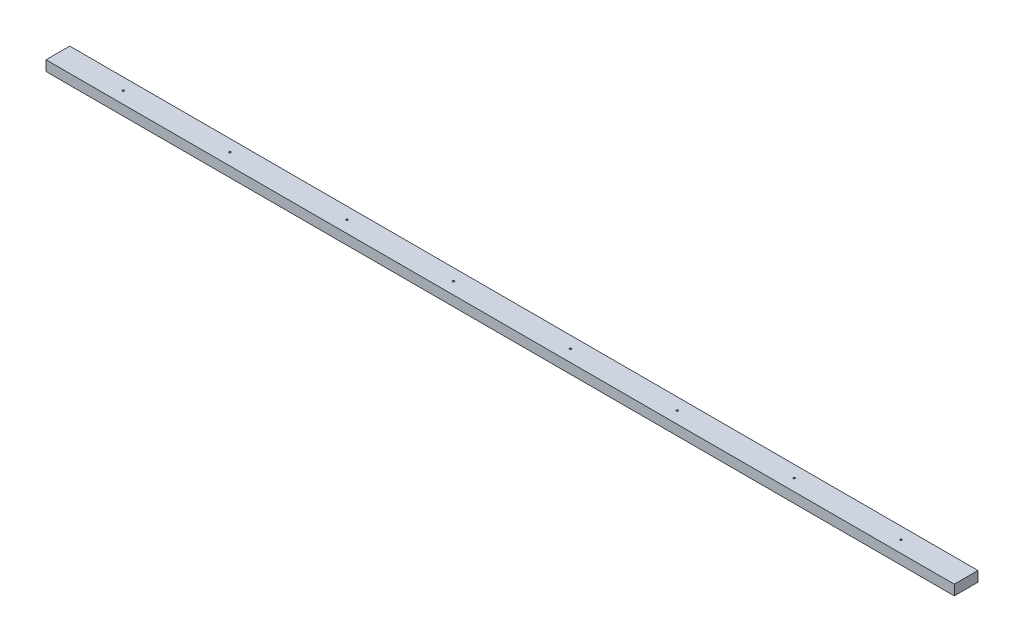
ISO-10303-21;
HEADER;
FILE_DESCRIPTION(('STEP AP214'),'2;1');
FILE_NAME('part.step','',(''),(''),'','','');
FILE_SCHEMA(('AUTOMOTIVE_DESIGN { 1 0 10303 214 1 1 1 1 }'));
ENDSEC;
DATA;
#1=APPLICATION_CONTEXT('core data for automotive mechanical design processes');
#2=APPLICATION_PROTOCOL_DEFINITION('international standard','automotive_design',2000,#1);
#3=PRODUCT_CONTEXT('',#1,'mechanical');
#4=PRODUCT('Part','Part','',(#3));
#5=PRODUCT_RELATED_PRODUCT_CATEGORY('part','',(#4));
#6=PRODUCT_DEFINITION_FORMATION('','',#4);
#7=PRODUCT_DEFINITION_CONTEXT('part definition',#1,'design');
#8=PRODUCT_DEFINITION('design','',#6,#7);
#9=PRODUCT_DEFINITION_SHAPE('','',#8);
#10=(LENGTH_UNIT() NAMED_UNIT(*) SI_UNIT(.MILLI.,.METRE.));
#11=(NAMED_UNIT(*) PLANE_ANGLE_UNIT() SI_UNIT($,.RADIAN.));
#12=(NAMED_UNIT(*) SI_UNIT($,.STERADIAN.) SOLID_ANGLE_UNIT());
#13=UNCERTAINTY_MEASURE_WITH_UNIT(LENGTH_MEASURE(1.E-05),#10,'distance_accuracy_value','');
#14=(GEOMETRIC_REPRESENTATION_CONTEXT(3) GLOBAL_UNCERTAINTY_ASSIGNED_CONTEXT((#13)) GLOBAL_UNIT_ASSIGNED_CONTEXT((#10,
#11,#12)) REPRESENTATION_CONTEXT('',''));
#15=CARTESIAN_POINT('',(0.,0.,0.));
#16=DIRECTION('',(0.,0.,1.));
#17=DIRECTION('',(1.,0.,0.));
#18=AXIS2_PLACEMENT_3D('',#15,#16,#17);
#19=CARTESIAN_POINT('',(3403.6,-19.05,-44.45));
#20=DIRECTION('',(0.,0.,1.));
#21=DIRECTION('',(1.,0.,0.));
#22=AXIS2_PLACEMENT_3D('',#19,#20,#21);
#23=PLANE('',#22);
#24=DIRECTION('',(0.,1.,0.));
#25=VECTOR('',#24,1.);
#26=CARTESIAN_POINT('',(0.,-19.05,-44.45));
#27=LINE('',#26,#25);
#28=CARTESIAN_POINT('',(0.,-19.05,-44.45));
#29=VERTEX_POINT('',#28);
#30=CARTESIAN_POINT('',(0.,19.05,-44.45));
#31=VERTEX_POINT('',#30);
#32=EDGE_CURVE('E112',#29,#31,#27,.T.);
#33=ORIENTED_EDGE('',*,*,#32,.T.);
#34=DIRECTION('',(-1.,0.,0.));
#35=VECTOR('',#34,1.);
#36=CARTESIAN_POINT('',(3403.6,19.05,-44.45));
#37=LINE('',#36,#35);
#38=CARTESIAN_POINT('',(3403.6,19.05,-44.45));
#39=VERTEX_POINT('',#38);
#40=EDGE_CURVE('E11',#39,#31,#37,.T.);
#41=ORIENTED_EDGE('',*,*,#40,.F.);
#42=DIRECTION('',(0.,1.,0.));
#43=VECTOR('',#42,1.);
#44=CARTESIAN_POINT('',(3403.6,-19.05,-44.45));
#45=LINE('',#44,#43);
#46=CARTESIAN_POINT('',(3403.6,-19.05,-44.45));
#47=VERTEX_POINT('',#46);
#48=EDGE_CURVE('E99',#47,#39,#45,.T.);
#49=ORIENTED_EDGE('',*,*,#48,.F.);
#50=DIRECTION('',(-1.,0.,0.));
#51=VECTOR('',#50,1.);
#52=CARTESIAN_POINT('',(3403.6,-19.05,-44.45));
#53=LINE('',#52,#51);
#54=EDGE_CURVE('E108',#47,#29,#53,.T.);
#55=ORIENTED_EDGE('',*,*,#54,.T.);
#56=EDGE_LOOP('',(#33,#41,#49,#55));
#57=FACE_BOUND('',#56,.T.);
#58=ADVANCED_FACE('F43',(#57),#23,.F.);
#59=CARTESIAN_POINT('',(3403.6,19.05,44.45));
#60=DIRECTION('',(0.,-1.,0.));
#61=DIRECTION('',(0.,0.,-1.));
#62=AXIS2_PLACEMENT_3D('',#59,#60,#61);
#63=PLANE('',#62);
#64=CARTESIAN_POINT('',(244.529,19.05,8.04911692853238E-13));
#65=DIRECTION('',(0.,-1.,0.));
#66=DIRECTION('',(0.,0.,-1.));
#67=AXIS2_PLACEMENT_3D('',#64,#65,#66);
#68=CIRCLE('',#67,3.58149999999999);
#69=CARTESIAN_POINT('',(244.529,19.05,-3.58149999999918));
#70=VERTEX_POINT('',#69);
#71=EDGE_CURVE('E116',#70,#70,#68,.T.);
#72=ORIENTED_EDGE('',*,*,#71,.T.);
#73=EDGE_LOOP('',(#72));
#74=FACE_BOUND('',#73,.T.);
#75=CARTESIAN_POINT('',(644.529,19.05,6.38378239159465E-13));
#76=DIRECTION('',(0.,-1.,0.));
#77=DIRECTION('',(0.,0.,-1.));
#78=AXIS2_PLACEMENT_3D('',#75,#76,#77);
#79=CIRCLE('',#78,3.58150000000007);
#80=CARTESIAN_POINT('',(644.529,19.05,-3.58149999999943));
#81=VERTEX_POINT('',#80);
#82=EDGE_CURVE('E174',#81,#81,#79,.T.);
#83=ORIENTED_EDGE('',*,*,#82,.T.);
#84=EDGE_LOOP('',(#83));
#85=FACE_BOUND('',#84,.T.);
#86=CARTESIAN_POINT('',(1082.729,19.05,-1.38777878078145E-13));
#87=DIRECTION('',(0.,-1.,0.));
#88=DIRECTION('',(0.,0.,-1.));
#89=AXIS2_PLACEMENT_3D('',#86,#87,#88);
#90=CIRCLE('',#89,3.58149999999985);
#91=CARTESIAN_POINT('',(1082.729,19.05,-3.58149999999998));
#92=VERTEX_POINT('',#91);
#93=EDGE_CURVE('E168',#92,#92,#90,.T.);
#94=ORIENTED_EDGE('',*,*,#93,.T.);
#95=EDGE_LOOP('',(#94));
#96=FACE_BOUND('',#95,.T.);
#97=CARTESIAN_POINT('',(1482.729,19.05,-1.94289029309402E-13));
#98=DIRECTION('',(0.,-1.,0.));
#99=DIRECTION('',(0.,0.,-1.));
#100=AXIS2_PLACEMENT_3D('',#97,#98,#99);
#101=CIRCLE('',#100,3.58149999999985);
#102=CARTESIAN_POINT('',(1482.729,19.05,-3.58150000000004));
#103=VERTEX_POINT('',#102);
#104=EDGE_CURVE('E161',#103,#103,#101,.T.);
#105=ORIENTED_EDGE('',*,*,#104,.T.);
#106=EDGE_LOOP('',(#105));
#107=FACE_BOUND('',#106,.T.);
#108=CARTESIAN_POINT('',(1920.929,19.05,3.60822483003176E-13));
#109=DIRECTION('',(0.,-1.,0.));
#110=DIRECTION('',(0.,0.,-1.));
#111=AXIS2_PLACEMENT_3D('',#108,#109,#110);
#112=CIRCLE('',#111,3.58149999999985);
#113=CARTESIAN_POINT('',(1920.929,19.05,-3.58149999999948));
#114=VERTEX_POINT('',#113);
#115=EDGE_CURVE('E154',#114,#114,#112,.T.);
#116=ORIENTED_EDGE('',*,*,#115,.T.);
#117=EDGE_LOOP('',(#116));
#118=FACE_BOUND('',#117,.T.);
#119=CARTESIAN_POINT('',(2320.929,19.05,1.94289029309402E-13));
#120=DIRECTION('',(0.,-1.,0.));
#121=DIRECTION('',(0.,0.,-1.));
#122=AXIS2_PLACEMENT_3D('',#119,#120,#121);
#123=CIRCLE('',#122,3.58150000000008);
#124=CARTESIAN_POINT('',(2320.929,19.05,-3.58149999999988));
#125=VERTEX_POINT('',#124);
#126=EDGE_CURVE('E147',#125,#125,#123,.T.);
#127=ORIENTED_EDGE('',*,*,#126,.T.);
#128=EDGE_LOOP('',(#127));
#129=FACE_BOUND('',#128,.T.);
#130=CARTESIAN_POINT('',(2759.129,19.05,-4.9960036108132E-13));
#131=DIRECTION('',(0.,-1.,0.));
#132=DIRECTION('',(0.,0.,-1.));
#133=AXIS2_PLACEMENT_3D('',#130,#131,#132);
#134=CIRCLE('',#133,3.58150000000008);
#135=CARTESIAN_POINT('',(2759.129,19.05,-3.58150000000058));
#136=VERTEX_POINT('',#135);
#137=EDGE_CURVE('E141',#136,#136,#134,.T.);
#138=ORIENTED_EDGE('',*,*,#137,.T.);
#139=EDGE_LOOP('',(#138));
#140=FACE_BOUND('',#139,.T.);
#141=CARTESIAN_POINT('',(3159.129,19.05,-6.10622663543836E-13));
#142=DIRECTION('',(0.,-1.,0.));
#143=DIRECTION('',(0.,0.,-1.));
#144=AXIS2_PLACEMENT_3D('',#141,#142,#143);
#145=CIRCLE('',#144,3.58150000000008);
#146=CARTESIAN_POINT('',(3159.129,19.05,-3.58150000000069));
#147=VERTEX_POINT('',#146);
#148=EDGE_CURVE('E135',#147,#147,#145,.T.);
#149=ORIENTED_EDGE('',*,*,#148,.T.);
#150=EDGE_LOOP('',(#149));
#151=FACE_BOUND('',#150,.T.);
#152=DIRECTION('',(0.,0.,1.));
#153=VECTOR('',#152,1.);
#154=CARTESIAN_POINT('',(0.,19.05,44.45));
#155=LINE('',#154,#153);
#156=CARTESIAN_POINT('',(0.,19.05,44.45));
#157=VERTEX_POINT('',#156);
#158=EDGE_CURVE('E103',#31,#157,#155,.T.);
#159=ORIENTED_EDGE('',*,*,#158,.T.);
#160=DIRECTION('',(-1.,0.,0.));
#161=VECTOR('',#160,1.);
#162=CARTESIAN_POINT('',(3403.6,19.05,44.45));
#163=LINE('',#162,#161);
#164=CARTESIAN_POINT('',(3403.6,19.05,44.45));
#165=VERTEX_POINT('',#164);
#166=EDGE_CURVE('E52',#165,#157,#163,.T.);
#167=ORIENTED_EDGE('',*,*,#166,.F.);
#168=DIRECTION('',(0.,0.,1.));
#169=VECTOR('',#168,1.);
#170=CARTESIAN_POINT('',(3403.6,19.05,44.45));
#171=LINE('',#170,#169);
#172=EDGE_CURVE('E94',#39,#165,#171,.T.);
#173=ORIENTED_EDGE('',*,*,#172,.F.);
#174=ORIENTED_EDGE('',*,*,#40,.T.);
#175=EDGE_LOOP('',(#159,#167,#173,#174));
#176=FACE_BOUND('',#175,.T.);
#177=ADVANCED_FACE('F102',(#74,#85,#96,#107,#118,#129,#140,#151,#176),#63,.F.);
#178=CARTESIAN_POINT('',(3403.6,-19.05,44.45));
#179=DIRECTION('',(0.,0.,-1.));
#180=DIRECTION('',(-1.,0.,0.));
#181=AXIS2_PLACEMENT_3D('',#178,#179,#180);
#182=PLANE('',#181);
#183=DIRECTION('',(0.,-1.,0.));
#184=VECTOR('',#183,1.);
#185=CARTESIAN_POINT('',(0.,-19.05,44.45));
#186=LINE('',#185,#184);
#187=CARTESIAN_POINT('',(0.,-19.05,44.45));
#188=VERTEX_POINT('',#187);
#189=EDGE_CURVE('E81',#157,#188,#186,.T.);
#190=ORIENTED_EDGE('',*,*,#189,.T.);
#191=DIRECTION('',(-1.,0.,0.));
#192=VECTOR('',#191,1.);
#193=CARTESIAN_POINT('',(3403.6,-19.05,44.45));
#194=LINE('',#193,#192);
#195=CARTESIAN_POINT('',(3403.6,-19.05,44.45));
#196=VERTEX_POINT('',#195);
#197=EDGE_CURVE('E105',#196,#188,#194,.T.);
#198=ORIENTED_EDGE('',*,*,#197,.F.);
#199=DIRECTION('',(0.,-1.,0.));
#200=VECTOR('',#199,1.);
#201=CARTESIAN_POINT('',(3403.6,-19.05,44.45));
#202=LINE('',#201,#200);
#203=EDGE_CURVE('E97',#165,#196,#202,.T.);
#204=ORIENTED_EDGE('',*,*,#203,.F.);
#205=ORIENTED_EDGE('',*,*,#166,.T.);
#206=EDGE_LOOP('',(#190,#198,#204,#205));
#207=FACE_BOUND('',#206,.T.);
#208=ADVANCED_FACE('F106',(#207),#182,.F.);
#209=CARTESIAN_POINT('',(3403.6,-19.05,44.45));
#210=DIRECTION('',(0.,1.,0.));
#211=DIRECTION('',(0.,0.,1.));
#212=AXIS2_PLACEMENT_3D('',#209,#210,#211);
#213=PLANE('',#212);
#214=CARTESIAN_POINT('',(244.529,-19.05,8.04911692853238E-13));
#215=DIRECTION('',(0.,-1.,0.));
#216=DIRECTION('',(0.,0.,-1.));
#217=AXIS2_PLACEMENT_3D('',#214,#215,#216);
#218=CIRCLE('',#217,3.58149999999999);
#219=CARTESIAN_POINT('',(244.529,-19.05,-3.58149999999918));
#220=VERTEX_POINT('',#219);
#221=EDGE_CURVE('E177',#220,#220,#218,.T.);
#222=ORIENTED_EDGE('',*,*,#221,.F.);
#223=EDGE_LOOP('',(#222));
#224=FACE_BOUND('',#223,.T.);
#225=CARTESIAN_POINT('',(644.529,-19.05,6.38378239159465E-13));
#226=DIRECTION('',(0.,-1.,0.));
#227=DIRECTION('',(0.,0.,-1.));
#228=AXIS2_PLACEMENT_3D('',#225,#226,#227);
#229=CIRCLE('',#228,3.58150000000007);
#230=CARTESIAN_POINT('',(644.529,-19.05,-3.58149999999943));
#231=VERTEX_POINT('',#230);
#232=EDGE_CURVE('E171',#231,#231,#229,.T.);
#233=ORIENTED_EDGE('',*,*,#232,.F.);
#234=EDGE_LOOP('',(#233));
#235=FACE_BOUND('',#234,.T.);
#236=CARTESIAN_POINT('',(1082.729,-19.05,-1.38777878078145E-13));
#237=DIRECTION('',(0.,-1.,0.));
#238=DIRECTION('',(0.,0.,-1.));
#239=AXIS2_PLACEMENT_3D('',#236,#237,#238);
#240=CIRCLE('',#239,3.58149999999985);
#241=CARTESIAN_POINT('',(1082.729,-19.05,-3.58149999999998));
#242=VERTEX_POINT('',#241);
#243=EDGE_CURVE('E164',#242,#242,#240,.T.);
#244=ORIENTED_EDGE('',*,*,#243,.F.);
#245=EDGE_LOOP('',(#244));
#246=FACE_BOUND('',#245,.T.);
#247=CARTESIAN_POINT('',(1482.729,-19.05,-1.94289029309402E-13));
#248=DIRECTION('',(0.,-1.,0.));
#249=DIRECTION('',(0.,0.,-1.));
#250=AXIS2_PLACEMENT_3D('',#247,#248,#249);
#251=CIRCLE('',#250,3.58149999999985);
#252=CARTESIAN_POINT('',(1482.729,-19.05,-3.58150000000004));
#253=VERTEX_POINT('',#252);
#254=EDGE_CURVE('E158',#253,#253,#251,.T.);
#255=ORIENTED_EDGE('',*,*,#254,.F.);
#256=EDGE_LOOP('',(#255));
#257=FACE_BOUND('',#256,.T.);
#258=CARTESIAN_POINT('',(1920.929,-19.05,3.60822483003176E-13));
#259=DIRECTION('',(0.,-1.,0.));
#260=DIRECTION('',(0.,0.,-1.));
#261=AXIS2_PLACEMENT_3D('',#258,#259,#260);
#262=CIRCLE('',#261,3.58149999999985);
#263=CARTESIAN_POINT('',(1920.929,-19.05,-3.58149999999948));
#264=VERTEX_POINT('',#263);
#265=EDGE_CURVE('E150',#264,#264,#262,.T.);
#266=ORIENTED_EDGE('',*,*,#265,.F.);
#267=EDGE_LOOP('',(#266));
#268=FACE_BOUND('',#267,.T.);
#269=CARTESIAN_POINT('',(2320.929,-19.05,1.94289029309402E-13));
#270=DIRECTION('',(0.,-1.,0.));
#271=DIRECTION('',(0.,0.,-1.));
#272=AXIS2_PLACEMENT_3D('',#269,#270,#271);
#273=CIRCLE('',#272,3.58150000000008);
#274=CARTESIAN_POINT('',(2320.929,-19.05,-3.58149999999988));
#275=VERTEX_POINT('',#274);
#276=EDGE_CURVE('E144',#275,#275,#273,.T.);
#277=ORIENTED_EDGE('',*,*,#276,.F.);
#278=EDGE_LOOP('',(#277));
#279=FACE_BOUND('',#278,.T.);
#280=CARTESIAN_POINT('',(2759.129,-19.05,-4.9960036108132E-13));
#281=DIRECTION('',(0.,-1.,0.));
#282=DIRECTION('',(0.,0.,-1.));
#283=AXIS2_PLACEMENT_3D('',#280,#281,#282);
#284=CIRCLE('',#283,3.58150000000008);
#285=CARTESIAN_POINT('',(2759.129,-19.05,-3.58150000000058));
#286=VERTEX_POINT('',#285);
#287=EDGE_CURVE('E138',#286,#286,#284,.T.);
#288=ORIENTED_EDGE('',*,*,#287,.F.);
#289=EDGE_LOOP('',(#288));
#290=FACE_BOUND('',#289,.T.);
#291=CARTESIAN_POINT('',(3159.129,-19.05,-6.10622663543836E-13));
#292=DIRECTION('',(0.,-1.,0.));
#293=DIRECTION('',(0.,0.,-1.));
#294=AXIS2_PLACEMENT_3D('',#291,#292,#293);
#295=CIRCLE('',#294,3.58150000000008);
#296=CARTESIAN_POINT('',(3159.129,-19.05,-3.58150000000069));
#297=VERTEX_POINT('',#296);
#298=EDGE_CURVE('E132',#297,#297,#295,.T.);
#299=ORIENTED_EDGE('',*,*,#298,.F.);
#300=EDGE_LOOP('',(#299));
#301=FACE_BOUND('',#300,.T.);
#302=DIRECTION('',(0.,0.,-1.));
#303=VECTOR('',#302,1.);
#304=CARTESIAN_POINT('',(0.,-19.05,44.45));
#305=LINE('',#304,#303);
#306=EDGE_CURVE('E87',#188,#29,#305,.T.);
#307=ORIENTED_EDGE('',*,*,#306,.T.);
#308=ORIENTED_EDGE('',*,*,#54,.F.);
#309=DIRECTION('',(0.,0.,-1.));
#310=VECTOR('',#309,1.);
#311=CARTESIAN_POINT('',(3403.6,-19.05,44.45));
#312=LINE('',#311,#310);
#313=EDGE_CURVE('E60',#196,#47,#312,.T.);
#314=ORIENTED_EDGE('',*,*,#313,.F.);
#315=ORIENTED_EDGE('',*,*,#197,.T.);
#316=EDGE_LOOP('',(#307,#308,#314,#315));
#317=FACE_BOUND('',#316,.T.);
#318=ADVANCED_FACE('F126',(#224,#235,#246,#257,#268,#279,#290,#301,#317),#213,.F.);
#319=CARTESIAN_POINT('',(3403.6,0.,0.));
#320=DIRECTION('',(-1.,0.,0.));
#321=DIRECTION('',(0.,0.,1.));
#322=AXIS2_PLACEMENT_3D('',#319,#320,#321);
#323=PLANE('',#322);
#324=ORIENTED_EDGE('',*,*,#48,.T.);
#325=ORIENTED_EDGE('',*,*,#172,.T.);
#326=ORIENTED_EDGE('',*,*,#203,.T.);
#327=ORIENTED_EDGE('',*,*,#313,.T.);
#328=EDGE_LOOP('',(#324,#325,#326,#327));
#329=FACE_BOUND('',#328,.T.);
#330=ADVANCED_FACE('F95',(#329),#323,.F.);
#331=CARTESIAN_POINT('',(0.,0.,0.));
#332=DIRECTION('',(-1.,0.,0.));
#333=DIRECTION('',(0.,0.,1.));
#334=AXIS2_PLACEMENT_3D('',#331,#332,#333);
#335=PLANE('',#334);
#336=ORIENTED_EDGE('',*,*,#32,.F.);
#337=ORIENTED_EDGE('',*,*,#306,.F.);
#338=ORIENTED_EDGE('',*,*,#189,.F.);
#339=ORIENTED_EDGE('',*,*,#158,.F.);
#340=EDGE_LOOP('',(#336,#337,#338,#339));
#341=FACE_BOUND('',#340,.T.);
#342=ADVANCED_FACE('F129',(#341),#335,.T.);
#343=CARTESIAN_POINT('',(3159.129,19.05,-6.10622663543836E-13));
#344=DIRECTION('',(0.,-1.,0.));
#345=DIRECTION('',(0.,0.,-1.));
#346=AXIS2_PLACEMENT_3D('',#343,#344,#345);
#347=CYLINDRICAL_SURFACE('',#346,3.58150000000008);
#348=ORIENTED_EDGE('',*,*,#148,.F.);
#349=EDGE_LOOP('',(#348));
#350=FACE_BOUND('',#349,.T.);
#351=ORIENTED_EDGE('',*,*,#298,.T.);
#352=EDGE_LOOP('',(#351));
#353=FACE_BOUND('',#352,.T.);
#354=ADVANCED_FACE('F211',(#350,#353),#347,.F.);
#355=CARTESIAN_POINT('',(2759.129,19.05,-4.9960036108132E-13));
#356=DIRECTION('',(0.,-1.,0.));
#357=DIRECTION('',(0.,0.,-1.));
#358=AXIS2_PLACEMENT_3D('',#355,#356,#357);
#359=CYLINDRICAL_SURFACE('',#358,3.58150000000008);
#360=ORIENTED_EDGE('',*,*,#137,.F.);
#361=EDGE_LOOP('',(#360));
#362=FACE_BOUND('',#361,.T.);
#363=ORIENTED_EDGE('',*,*,#287,.T.);
#364=EDGE_LOOP('',(#363));
#365=FACE_BOUND('',#364,.T.);
#366=ADVANCED_FACE('F213',(#362,#365),#359,.F.);
#367=CARTESIAN_POINT('',(2320.929,19.05,1.94289029309402E-13));
#368=DIRECTION('',(0.,-1.,0.));
#369=DIRECTION('',(0.,0.,-1.));
#370=AXIS2_PLACEMENT_3D('',#367,#368,#369);
#371=CYLINDRICAL_SURFACE('',#370,3.58150000000008);
#372=ORIENTED_EDGE('',*,*,#126,.F.);
#373=EDGE_LOOP('',(#372));
#374=FACE_BOUND('',#373,.T.);
#375=ORIENTED_EDGE('',*,*,#276,.T.);
#376=EDGE_LOOP('',(#375));
#377=FACE_BOUND('',#376,.T.);
#378=ADVANCED_FACE('F220',(#374,#377),#371,.F.);
#379=CARTESIAN_POINT('',(1920.929,19.05,3.60822483003176E-13));
#380=DIRECTION('',(0.,-1.,0.));
#381=DIRECTION('',(0.,0.,-1.));
#382=AXIS2_PLACEMENT_3D('',#379,#380,#381);
#383=CYLINDRICAL_SURFACE('',#382,3.58149999999985);
#384=ORIENTED_EDGE('',*,*,#115,.F.);
#385=EDGE_LOOP('',(#384));
#386=FACE_BOUND('',#385,.T.);
#387=ORIENTED_EDGE('',*,*,#265,.T.);
#388=EDGE_LOOP('',(#387));
#389=FACE_BOUND('',#388,.T.);
#390=ADVANCED_FACE('F270',(#386,#389),#383,.F.);
#391=CARTESIAN_POINT('',(1482.729,19.05,-1.94289029309402E-13));
#392=DIRECTION('',(0.,-1.,0.));
#393=DIRECTION('',(0.,0.,-1.));
#394=AXIS2_PLACEMENT_3D('',#391,#392,#393);
#395=CYLINDRICAL_SURFACE('',#394,3.58149999999985);
#396=ORIENTED_EDGE('',*,*,#104,.F.);
#397=EDGE_LOOP('',(#396));
#398=FACE_BOUND('',#397,.T.);
#399=ORIENTED_EDGE('',*,*,#254,.T.);
#400=EDGE_LOOP('',(#399));
#401=FACE_BOUND('',#400,.T.);
#402=ADVANCED_FACE('F280',(#398,#401),#395,.F.);
#403=CARTESIAN_POINT('',(1082.729,19.05,-1.38777878078145E-13));
#404=DIRECTION('',(0.,-1.,0.));
#405=DIRECTION('',(0.,0.,-1.));
#406=AXIS2_PLACEMENT_3D('',#403,#404,#405);
#407=CYLINDRICAL_SURFACE('',#406,3.58149999999985);
#408=ORIENTED_EDGE('',*,*,#93,.F.);
#409=EDGE_LOOP('',(#408));
#410=FACE_BOUND('',#409,.T.);
#411=ORIENTED_EDGE('',*,*,#243,.T.);
#412=EDGE_LOOP('',(#411));
#413=FACE_BOUND('',#412,.T.);
#414=ADVANCED_FACE('F290',(#410,#413),#407,.F.);
#415=CARTESIAN_POINT('',(644.529,19.05,6.38378239159465E-13));
#416=DIRECTION('',(0.,-1.,0.));
#417=DIRECTION('',(0.,0.,-1.));
#418=AXIS2_PLACEMENT_3D('',#415,#416,#417);
#419=CYLINDRICAL_SURFACE('',#418,3.58150000000007);
#420=ORIENTED_EDGE('',*,*,#82,.F.);
#421=EDGE_LOOP('',(#420));
#422=FACE_BOUND('',#421,.T.);
#423=ORIENTED_EDGE('',*,*,#232,.T.);
#424=EDGE_LOOP('',(#423));
#425=FACE_BOUND('',#424,.T.);
#426=ADVANCED_FACE('F190',(#422,#425),#419,.F.);
#427=CARTESIAN_POINT('',(244.529,19.05,8.04911692853238E-13));
#428=DIRECTION('',(0.,-1.,0.));
#429=DIRECTION('',(0.,0.,-1.));
#430=AXIS2_PLACEMENT_3D('',#427,#428,#429);
#431=CYLINDRICAL_SURFACE('',#430,3.58149999999999);
#432=ORIENTED_EDGE('',*,*,#71,.F.);
#433=EDGE_LOOP('',(#432));
#434=FACE_BOUND('',#433,.T.);
#435=ORIENTED_EDGE('',*,*,#221,.T.);
#436=EDGE_LOOP('',(#435));
#437=FACE_BOUND('',#436,.T.);
#438=ADVANCED_FACE('F187',(#434,#437),#431,.F.);
#439=CLOSED_SHELL('',(#58,#177,#208,#318,#330,#342,#354,#366,#378,#390,#402,#414,#426,#438));
#440=MANIFOLD_SOLID_BREP('B2',#439);
#441=ADVANCED_BREP_SHAPE_REPRESENTATION('',(#18,#440),#14);
#442=SHAPE_DEFINITION_REPRESENTATION(#9,#441);
ENDSEC;
END-ISO-10303-21;
